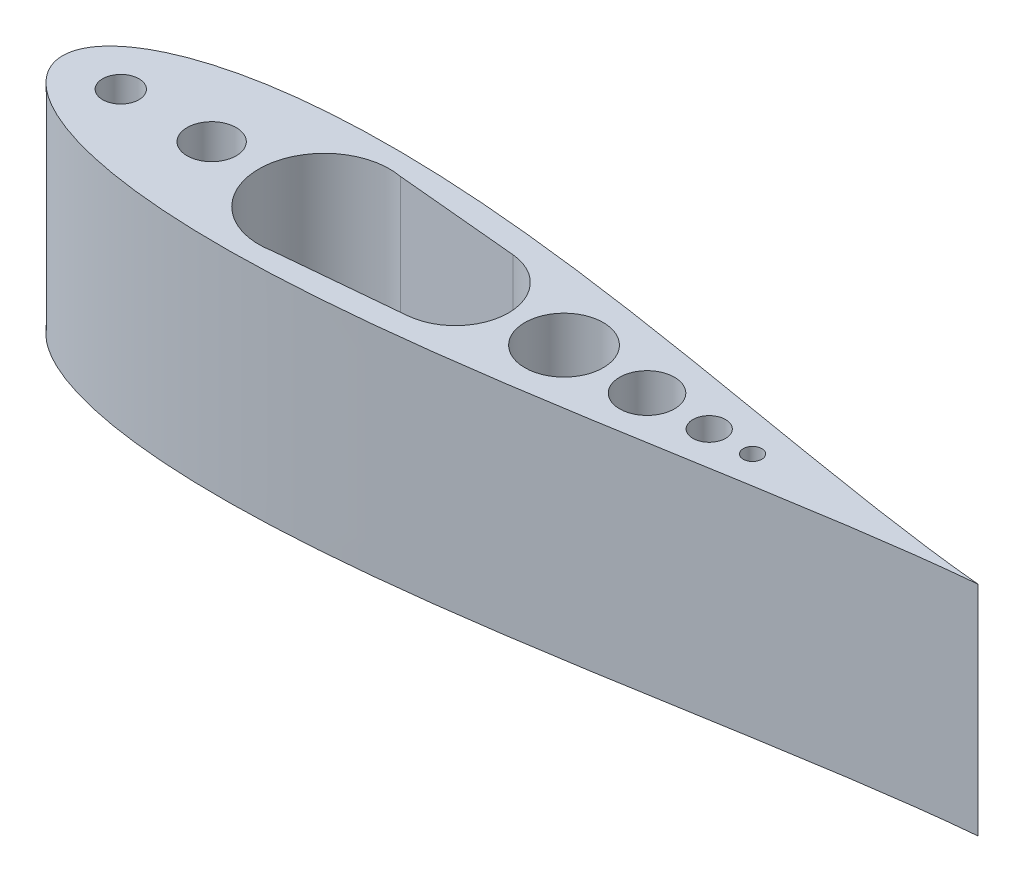
ISO-10303-21;
HEADER;
FILE_DESCRIPTION(('STEP AP214'),'2;1');
FILE_NAME('part.step','',(''),(''),'','','');
FILE_SCHEMA(('AUTOMOTIVE_DESIGN { 1 0 10303 214 1 1 1 1 }'));
ENDSEC;
DATA;
#1=APPLICATION_CONTEXT('core data for automotive mechanical design processes');
#2=APPLICATION_PROTOCOL_DEFINITION('international standard','automotive_design',2000,#1);
#3=PRODUCT_CONTEXT('',#1,'mechanical');
#4=PRODUCT('Part','Part','',(#3));
#5=PRODUCT_RELATED_PRODUCT_CATEGORY('part','',(#4));
#6=PRODUCT_DEFINITION_FORMATION('','',#4);
#7=PRODUCT_DEFINITION_CONTEXT('part definition',#1,'design');
#8=PRODUCT_DEFINITION('design','',#6,#7);
#9=PRODUCT_DEFINITION_SHAPE('','',#8);
#10=(LENGTH_UNIT() NAMED_UNIT(*) SI_UNIT(.MILLI.,.METRE.));
#11=(NAMED_UNIT(*) PLANE_ANGLE_UNIT() SI_UNIT($,.RADIAN.));
#12=(NAMED_UNIT(*) SI_UNIT($,.STERADIAN.) SOLID_ANGLE_UNIT());
#13=UNCERTAINTY_MEASURE_WITH_UNIT(LENGTH_MEASURE(1.E-05),#10,'distance_accuracy_value','');
#14=(GEOMETRIC_REPRESENTATION_CONTEXT(3) GLOBAL_UNCERTAINTY_ASSIGNED_CONTEXT((#13)) GLOBAL_UNIT_ASSIGNED_CONTEXT((#10,
#11,#12)) REPRESENTATION_CONTEXT('',''));
#15=CARTESIAN_POINT('',(0.,0.,0.));
#16=DIRECTION('',(0.,0.,1.));
#17=DIRECTION('',(1.,0.,0.));
#18=AXIS2_PLACEMENT_3D('',#15,#16,#17);
#19=CARTESIAN_POINT('',(1.01618101338774,50.8000000000002,10.8993353954472));
#20=DIRECTION('',(-0.0928307105142229,0.,-0.995681906627513));
#21=DIRECTION('',(-0.995681906627513,0.,0.0928307105142229));
#22=AXIS2_PLACEMENT_3D('',#19,#20,#21);
#23=PLANE('',#22);
#24=DIRECTION('',(0.995681906627513,0.,-0.0928307105142229));
#25=VECTOR('',#24,1.);
#26=CARTESIAN_POINT('',(1.0161810133904,0.,10.8993353954477));
#27=LINE('',#26,#25);
#28=CARTESIAN_POINT('',(-42.7235764956553,0.,14.9773373559711));
#29=VERTEX_POINT('',#28);
#30=CARTESIAN_POINT('',(-13.8473201339071,0.,12.2851086660564));
#31=VERTEX_POINT('',#30);
#32=EDGE_CURVE('E202',#29,#31,#27,.T.);
#33=ORIENTED_EDGE('',*,*,#32,.F.);
#34=DIRECTION('',(0.,-1.,0.));
#35=VECTOR('',#34,1.);
#36=CARTESIAN_POINT('',(-42.7235764956557,50.8000000000002,14.9773373559701));
#37=LINE('',#36,#35);
#38=CARTESIAN_POINT('',(-42.7235764956557,50.8000000000002,14.9773373559701));
#39=VERTEX_POINT('',#38);
#40=EDGE_CURVE('E13',#39,#29,#37,.T.);
#41=ORIENTED_EDGE('',*,*,#40,.F.);
#42=DIRECTION('',(0.995681906627513,0.,-0.0928307105142229));
#43=VECTOR('',#42,1.);
#44=CARTESIAN_POINT('',(1.01618101338774,50.8000000000002,10.8993353954472));
#45=LINE('',#44,#43);
#46=CARTESIAN_POINT('',(-13.8473201339049,50.8000000000002,12.2851086660559));
#47=VERTEX_POINT('',#46);
#48=EDGE_CURVE('E149',#39,#47,#45,.T.);
#49=ORIENTED_EDGE('',*,*,#48,.T.);
#50=DIRECTION('',(0.,-1.,0.));
#51=VECTOR('',#50,1.);
#52=CARTESIAN_POINT('',(-13.8473201339049,50.8000000000002,12.2851086660559));
#53=LINE('',#52,#51);
#54=EDGE_CURVE('E78',#47,#31,#53,.T.);
#55=ORIENTED_EDGE('',*,*,#54,.T.);
#56=EDGE_LOOP('',(#33,#41,#49,#55));
#57=FACE_BOUND('',#56,.T.);
#58=ADVANCED_FACE('F54',(#57),#23,.T.);
#59=CARTESIAN_POINT('',(-45.5408385930507,50.8000000000002,-6.66133814775094E-13));
#60=DIRECTION('',(0.,-1.,0.));
#61=DIRECTION('',(0.,0.,-0.999999999999999));
#62=AXIS2_PLACEMENT_3D('',#59,#60,#61);
#63=CYLINDRICAL_SURFACE('',#62,15.24);
#64=CARTESIAN_POINT('',(-45.5408385930507,0.,-6.66133814775094E-13));
#65=DIRECTION('',(0.,1.,0.));
#66=DIRECTION('',(0.,0.,0.999999999999999));
#67=AXIS2_PLACEMENT_3D('',#64,#65,#66);
#68=CIRCLE('',#67,15.24);
#69=CARTESIAN_POINT('',(-42.7235764956562,0.,-14.9773373559718));
#70=VERTEX_POINT('',#69);
#71=EDGE_CURVE('E134',#70,#29,#68,.T.);
#72=ORIENTED_EDGE('',*,*,#71,.F.);
#73=DIRECTION('',(0.,-1.,0.));
#74=VECTOR('',#73,1.);
#75=CARTESIAN_POINT('',(-42.7235764956562,50.8000000000002,-14.9773373559718));
#76=LINE('',#75,#74);
#77=CARTESIAN_POINT('',(-42.7235764956562,50.8000000000002,-14.9773373559718));
#78=VERTEX_POINT('',#77);
#79=EDGE_CURVE('E66',#78,#70,#76,.T.);
#80=ORIENTED_EDGE('',*,*,#79,.F.);
#81=CARTESIAN_POINT('',(-45.5408385930507,50.8000000000002,-6.66133814775094E-13));
#82=DIRECTION('',(0.,1.,0.));
#83=DIRECTION('',(0.,0.,0.999999999999999));
#84=AXIS2_PLACEMENT_3D('',#81,#82,#83);
#85=CIRCLE('',#84,15.24);
#86=EDGE_CURVE('E132',#78,#39,#85,.T.);
#87=ORIENTED_EDGE('',*,*,#86,.T.);
#88=ORIENTED_EDGE('',*,*,#40,.T.);
#89=EDGE_LOOP('',(#72,#80,#87,#88));
#90=FACE_BOUND('',#89,.T.);
#91=ADVANCED_FACE('F130',(#90),#63,.F.);
#92=CARTESIAN_POINT('',(1.01618101338996,50.8000000000002,-10.8993353954502));
#93=DIRECTION('',(0.0928307105141881,0.,-0.995681906627529));
#94=DIRECTION('',(-0.99568190662752,0.,-0.0928307105141876));
#95=AXIS2_PLACEMENT_3D('',#92,#93,#94);
#96=PLANE('',#95);
#97=DIRECTION('',(0.99568190662752,0.,0.0928307105141876));
#98=VECTOR('',#97,1.);
#99=CARTESIAN_POINT('',(1.01618101339174,0.,-10.8993353954501));
#100=LINE('',#99,#98);
#101=CARTESIAN_POINT('',(-13.8473201339064,0.,-12.2851086660578));
#102=VERTEX_POINT('',#101);
#103=EDGE_CURVE('E207',#70,#102,#100,.T.);
#104=ORIENTED_EDGE('',*,*,#103,.T.);
#105=DIRECTION('',(0.,-1.,0.));
#106=VECTOR('',#105,1.);
#107=CARTESIAN_POINT('',(-13.8473201339067,50.8000000000002,-12.2851086660578));
#108=LINE('',#107,#106);
#109=CARTESIAN_POINT('',(-13.8473201339067,50.8000000000002,-12.2851086660578));
#110=VERTEX_POINT('',#109);
#111=EDGE_CURVE('E103',#110,#102,#108,.T.);
#112=ORIENTED_EDGE('',*,*,#111,.F.);
#113=DIRECTION('',(0.99568190662752,0.,0.0928307105141876));
#114=VECTOR('',#113,1.);
#115=CARTESIAN_POINT('',(1.01618101338996,50.8000000000002,-10.8993353954502));
#116=LINE('',#115,#114);
#117=EDGE_CURVE('E139',#78,#110,#116,.T.);
#118=ORIENTED_EDGE('',*,*,#117,.F.);
#119=ORIENTED_EDGE('',*,*,#79,.T.);
#120=EDGE_LOOP('',(#104,#112,#118,#119));
#121=FACE_BOUND('',#120,.T.);
#122=ADVANCED_FACE('F140',(#121),#96,.F.);
#123=CARTESIAN_POINT('',(-106.482983395141,50.8000000000002,-7.35711491728352E-09));
#124=CARTESIAN_POINT('',(-106.481988205194,50.8000000000002,-0.336221446682217));
#125=CARTESIAN_POINT('',(-106.427915569485,50.8000000000002,-1.17247085157146));
#126=CARTESIAN_POINT('',(-106.105951463751,50.8000000000002,-2.64309926860695));
#127=CARTESIAN_POINT('',(-105.314009735291,50.8000000000002,-4.47521740832113));
#128=CARTESIAN_POINT('',(-103.897531118632,50.8000000000002,-6.50434841864622));
#129=CARTESIAN_POINT('',(-101.808045378182,50.8000000000002,-8.57165133235582));
#130=CARTESIAN_POINT('',(-99.0667178405027,50.8000000000002,-10.5675567036545));
#131=CARTESIAN_POINT('',(-95.7198031883872,50.8000000000002,-12.4267472996131));
#132=CARTESIAN_POINT('',(-91.8173324289486,50.8000000000002,-14.1114417112703));
#133=CARTESIAN_POINT('',(-87.4067018354783,50.8000000000002,-15.5993181619873));
#134=CARTESIAN_POINT('',(-82.5319070115311,50.8000000000002,-16.8771333229454));
#135=CARTESIAN_POINT('',(-77.2341496539688,50.8000000000002,-17.9374356197238));
#136=CARTESIAN_POINT('',(-71.5526070979129,50.8000000000002,-18.7767405724233));
#137=CARTESIAN_POINT('',(-65.5251476056229,50.8000000000002,-19.3954605858546));
#138=CARTESIAN_POINT('',(-59.1885914175649,50.8000000000002,-19.796574030114));
#139=CARTESIAN_POINT('',(-52.5790530798464,50.8000000000002,-19.9862763161083));
#140=CARTESIAN_POINT('',(-45.7320019639342,50.8000000000002,-19.9728658373552));
#141=CARTESIAN_POINT('',(-38.6823636938898,50.8000000000002,-19.767322469751));
#142=CARTESIAN_POINT('',(-31.4645229280415,50.8000000000002,-19.3825524779145));
#143=CARTESIAN_POINT('',(-24.1123351486494,50.8000000000002,-18.8333174672924));
#144=CARTESIAN_POINT('',(-16.6591158210672,50.8000000000002,-18.1360009675592));
#145=CARTESIAN_POINT('',(-9.13763404320456,50.8000000000002,-17.308302016678));
#146=CARTESIAN_POINT('',(-1.58011288129267,50.8000000000002,-16.3689060143253));
#147=CARTESIAN_POINT('',(5.98177290974711,50.8000000000002,-15.3372135342327));
#148=CARTESIAN_POINT('',(13.516891028539,50.8000000000002,-14.2329994071528));
#149=CARTESIAN_POINT('',(20.9946456094969,50.8000000000002,-13.0761298482217));
#150=CARTESIAN_POINT('',(28.3849687391617,50.8000000000002,-11.8862100008007));
#151=CARTESIAN_POINT('',(35.658323250916,50.8000000000002,-10.6823363143886));
#152=CARTESIAN_POINT('',(42.7857029072638,50.8000000000002,-9.48275912363772));
#153=CARTESIAN_POINT('',(49.7386474254316,50.8000000000002,-8.30463778684876));
#154=CARTESIAN_POINT('',(56.4892656841125,50.8000000000002,-7.16376071809477));
#155=CARTESIAN_POINT('',(63.0102811144397,50.8000000000002,-6.07435669901601));
#156=CARTESIAN_POINT('',(69.2750767276764,50.8000000000002,-5.04884141157447));
#157=CARTESIAN_POINT('',(75.2577811056072,50.8000000000002,-4.09769207062927));
#158=CARTESIAN_POINT('',(80.9333433114536,50.8000000000002,-3.22931724888975));
#159=CARTESIAN_POINT('',(86.2776693757101,50.8000000000002,-2.44984621283573));
#160=CARTESIAN_POINT('',(91.2676183232592,50.8000000000002,-1.76329204938852));
#161=CARTESIAN_POINT('',(95.8816071163993,50.8000000000002,-1.17122475958265));
#162=CARTESIAN_POINT('',(100.098099776026,50.8000000000002,-0.673119163771663));
#163=CARTESIAN_POINT('',(103.673185129137,50.8000000000002,-0.290516392496332));
#164=CARTESIAN_POINT('',(105.836141219668,50.8000000000002,-0.081745653859544));
#165=CARTESIAN_POINT('',(106.733370690548,50.8000000000002,-7.30127069914488E-09));
#166=B_SPLINE_CURVE_WITH_KNOTS('',3,(#123,#124,#125,#126,#127,#128,#129,#130,#131,#132,#133,
#134,#135,#136,#137,#138,#139,#140,#141,#142,#143,#144,#145,#146,#147,#148,#149,#150,#151,#152,
#153,#154,#155,#156,#157,#158,#159,#160,#161,#162,#163,#164,#165),.UNSPECIFIED.,.F.,.F.,(4,1,1,
1,1,1,1,1,1,1,1,1,1,1,1,1,1,1,1,1,1,1,1,1,1,1,1,1,1,1,1,1,1,1,1,1,1,1,1,1,4),(0.5,
0.502166768562745,0.505390167385713,0.509655974305835,0.514947681887198,0.521244711429097,
0.528520886222697,0.536744945012688,0.545881360311019,0.555890751085959,0.566730118512969,
0.578352990409744,0.59070958813284,0.603747039427916,0.617409572172202,0.631638768029288,
0.646373793426418,0.66155165817642,0.677107482822761,0.692974771091203,0.709085712601986,
0.725371443301651,0.741762353139131,0.758188398075751,0.774579367488477,0.790865214368963,
0.806976331929698,0.822843867373426,0.838400001999155,0.853578261502887,0.868313774347479,
0.882543568085681,0.896206835422454,0.909245173309164,0.921602869650348,0.933227116385514,
0.944068236336681,0.954079898096736,0.963219316327445,0.971447444986932,0.977251073986684),.UNSPECIFIED.);
#167=DIRECTION('',(0.,-1.,0.));
#168=VECTOR('',#167,1.);
#169=SURFACE_OF_LINEAR_EXTRUSION('',#166,#168);
#170=CARTESIAN_POINT('',(-106.48298339514,0.,-7.35644878346875E-09));
#171=CARTESIAN_POINT('',(-106.481988205194,0.,-0.336221446682439));
#172=CARTESIAN_POINT('',(-106.427915569481,0.,-1.17247085156924));
#173=CARTESIAN_POINT('',(-106.10595146375,0.,-2.64309926860518));
#174=CARTESIAN_POINT('',(-105.314009735291,0.,-4.47521740832113));
#175=CARTESIAN_POINT('',(-103.897531118632,0.,-6.50434841864622));
#176=CARTESIAN_POINT('',(-101.808045378182,0.,-8.57165133235582));
#177=CARTESIAN_POINT('',(-99.0667178405016,0.,-10.5675567036544));
#178=CARTESIAN_POINT('',(-95.7198031883877,0.,-12.4267472996129));
#179=CARTESIAN_POINT('',(-91.8173324289491,0.,-14.1114417112695));
#180=CARTESIAN_POINT('',(-87.4067018354761,0.,-15.599318161988));
#181=CARTESIAN_POINT('',(-82.5319070115311,0.,-16.8771333229454));
#182=CARTESIAN_POINT('',(-77.2341496539699,0.,-17.9374356197234));
#183=CARTESIAN_POINT('',(-71.5526070979142,0.,-18.7767405724225));
#184=CARTESIAN_POINT('',(-65.5251476056229,0.,-19.3954605858546));
#185=CARTESIAN_POINT('',(-59.1885914175649,0.,-19.796574030114));
#186=CARTESIAN_POINT('',(-52.5790530798464,0.,-19.9862763161083));
#187=CARTESIAN_POINT('',(-45.7320019639342,0.,-19.9728658373552));
#188=CARTESIAN_POINT('',(-38.6823636938896,0.,-19.7673224697512));
#189=CARTESIAN_POINT('',(-31.464522928041,0.,-19.3825524779148));
#190=CARTESIAN_POINT('',(-24.1123351486494,0.,-18.8333174672924));
#191=CARTESIAN_POINT('',(-16.6591158210672,0.,-18.1360009675592));
#192=CARTESIAN_POINT('',(-9.13763404320456,0.,-17.308302016678));
#193=CARTESIAN_POINT('',(-1.58011288128979,0.,-16.3689060143264));
#194=CARTESIAN_POINT('',(5.98177290974622,0.,-15.3372135342329));
#195=CARTESIAN_POINT('',(13.5168910285355,0.,-14.2329994071548));
#196=CARTESIAN_POINT('',(20.9946456094969,0.,-13.0761298482217));
#197=CARTESIAN_POINT('',(28.384968739162,0.,-11.8862100007999));
#198=CARTESIAN_POINT('',(35.658323250916,0.,-10.6823363143886));
#199=CARTESIAN_POINT('',(42.7857029072638,0.,-9.48275912363661));
#200=CARTESIAN_POINT('',(49.7386474254316,0.,-8.30463778684876));
#201=CARTESIAN_POINT('',(56.4892656841125,0.,-7.16376071809477));
#202=CARTESIAN_POINT('',(63.0102811144417,0.,-6.07435669901546));
#203=CARTESIAN_POINT('',(69.2750767276742,0.,-5.0488414115728));
#204=CARTESIAN_POINT('',(75.2577811056092,0.,-4.09769207062871));
#205=CARTESIAN_POINT('',(80.9333433114536,0.,-3.22931724888975));
#206=CARTESIAN_POINT('',(86.2776693757101,0.,-2.44984621283573));
#207=CARTESIAN_POINT('',(91.2676183232592,0.,-1.76329204938852));
#208=CARTESIAN_POINT('',(95.8816071164008,0.,-1.1712247595822));
#209=CARTESIAN_POINT('',(100.098099776027,0.,-0.673119163771663));
#210=CARTESIAN_POINT('',(103.673185129136,0.,-0.290516392495777));
#211=CARTESIAN_POINT('',(105.836141219668,0.,-0.081745653859322));
#212=CARTESIAN_POINT('',(106.733370690548,0.,-7.30115967684242E-09));
#213=B_SPLINE_CURVE_WITH_KNOTS('',3,(#170,#171,#172,#173,#174,#175,#176,#177,#178,#179,#180,
#181,#182,#183,#184,#185,#186,#187,#188,#189,#190,#191,#192,#193,#194,#195,#196,#197,#198,#199,
#200,#201,#202,#203,#204,#205,#206,#207,#208,#209,#210,#211,#212),.UNSPECIFIED.,.F.,.F.,(4,1,1,
1,1,1,1,1,1,1,1,1,1,1,1,1,1,1,1,1,1,1,1,1,1,1,1,1,1,1,1,1,1,1,1,1,1,1,1,1,4),(0.5,
0.502166768562745,0.505390167385713,0.509655974305835,0.514947681887198,0.521244711429097,
0.528520886222697,0.536744945012688,0.545881360311019,0.555890751085959,0.566730118512969,
0.578352990409744,0.59070958813284,0.603747039427916,0.617409572172202,0.631638768029288,
0.646373793426418,0.66155165817642,0.677107482822761,0.692974771091203,0.709085712601986,
0.725371443301651,0.741762353139131,0.758188398075751,0.774579367488477,0.790865214368963,
0.806976331929698,0.822843867373426,0.838400001999155,0.853578261502887,0.868313774347479,
0.882543568085681,0.896206835422454,0.909245173309164,0.921602869650348,0.933227116385514,
0.944068236336681,0.954079898096736,0.963219316327445,0.971447444986932,0.977251073986684),.UNSPECIFIED.);
#214=CARTESIAN_POINT('',(-106.48298339514,0.,-7.35644878346875E-09));
#215=VERTEX_POINT('',#214);
#216=CARTESIAN_POINT('',(106.73337069055,0.,7.30027149842272E-09));
#217=VERTEX_POINT('',#216);
#218=EDGE_CURVE('E181',#215,#217,#213,.T.);
#219=ORIENTED_EDGE('',*,*,#218,.F.);
#220=DIRECTION('',(0.,-1.,0.));
#221=VECTOR('',#220,1.);
#222=CARTESIAN_POINT('',(-106.482983395141,50.8000000000002,-7.35711491728352E-09));
#223=LINE('',#222,#221);
#224=CARTESIAN_POINT('',(-106.482983395141,50.8000000000002,-7.35711491728352E-09));
#225=VERTEX_POINT('',#224);
#226=EDGE_CURVE('E59',#225,#215,#223,.T.);
#227=ORIENTED_EDGE('',*,*,#226,.F.);
#228=CARTESIAN_POINT('',(106.73337069055,50.8000000000002,7.29816207467593E-09));
#229=VERTEX_POINT('',#228);
#230=EDGE_CURVE('E234',#225,#229,#166,.T.);
#231=ORIENTED_EDGE('',*,*,#230,.T.);
#232=DIRECTION('',(0.,-1.,0.));
#233=VECTOR('',#232,1.);
#234=CARTESIAN_POINT('',(106.73337069055,50.8000000000002,7.29816207467593E-09));
#235=LINE('',#234,#233);
#236=EDGE_CURVE('E180',#229,#217,#235,.T.);
#237=ORIENTED_EDGE('',*,*,#236,.T.);
#238=EDGE_LOOP('',(#219,#227,#231,#237));
#239=FACE_BOUND('',#238,.T.);
#240=ADVANCED_FACE('F56',(#239),#169,.T.);
#241=CARTESIAN_POINT('',(44.1262695669535,50.8000000000002,-2.22044604925031E-13));
#242=DIRECTION('',(0.,-1.,0.));
#243=DIRECTION('',(0.,0.,-0.999999999999999));
#244=AXIS2_PLACEMENT_3D('',#241,#242,#243);
#245=CYLINDRICAL_SURFACE('',#244,3.80999999961901);
#246=CARTESIAN_POINT('',(44.1262695669535,50.8000000000002,-2.22044604925031E-13));
#247=DIRECTION('',(0.,1.,0.));
#248=DIRECTION('',(0.,0.,0.999999999999999));
#249=AXIS2_PLACEMENT_3D('',#246,#247,#248);
#250=CIRCLE('',#249,3.80999999961901);
#251=CARTESIAN_POINT('',(44.1262695669535,50.8000000000002,3.80999999961878));
#252=VERTEX_POINT('',#251);
#253=EDGE_CURVE('E172',#252,#252,#250,.T.);
#254=ORIENTED_EDGE('',*,*,#253,.T.);
#255=EDGE_LOOP('',(#254));
#256=FACE_BOUND('',#255,.T.);
#257=CARTESIAN_POINT('',(44.1262695669535,0.,-2.22044604925031E-13));
#258=DIRECTION('',(0.,1.,0.));
#259=DIRECTION('',(0.,0.,0.999999999999999));
#260=AXIS2_PLACEMENT_3D('',#257,#258,#259);
#261=CIRCLE('',#260,3.80999999961901);
#262=CARTESIAN_POINT('',(44.1262695669535,0.,3.80999999961878));
#263=VERTEX_POINT('',#262);
#264=EDGE_CURVE('E226',#263,#263,#261,.T.);
#265=ORIENTED_EDGE('',*,*,#264,.F.);
#266=EDGE_LOOP('',(#265));
#267=FACE_BOUND('',#266,.T.);
#268=ADVANCED_FACE('F252',(#256,#267),#245,.F.);
#269=CARTESIAN_POINT('',(29.6435174290028,50.8000000000002,-1.99840144432528E-12));
#270=DIRECTION('',(0.,-1.,0.));
#271=DIRECTION('',(0.,0.,-0.999999999999999));
#272=AXIS2_PLACEMENT_3D('',#269,#270,#271);
#273=CYLINDRICAL_SURFACE('',#272,6.39233333269412);
#274=CARTESIAN_POINT('',(29.6435174290028,50.8000000000002,-1.99840144432528E-12));
#275=DIRECTION('',(0.,1.,0.));
#276=DIRECTION('',(0.,0.,0.999999999999999));
#277=AXIS2_PLACEMENT_3D('',#274,#275,#276);
#278=CIRCLE('',#277,6.39233333269412);
#279=CARTESIAN_POINT('',(29.6435174290028,50.8000000000002,6.39233333269212));
#280=VERTEX_POINT('',#279);
#281=EDGE_CURVE('E168',#280,#280,#278,.T.);
#282=ORIENTED_EDGE('',*,*,#281,.T.);
#283=EDGE_LOOP('',(#282));
#284=FACE_BOUND('',#283,.T.);
#285=CARTESIAN_POINT('',(29.6435174290006,0.,-4.44089209850063E-13));
#286=DIRECTION('',(0.,1.,0.));
#287=DIRECTION('',(0.,0.,0.999999999999999));
#288=AXIS2_PLACEMENT_3D('',#285,#286,#287);
#289=CIRCLE('',#288,6.39233333269412);
#290=CARTESIAN_POINT('',(29.6435174290006,0.,6.39233333269367));
#291=VERTEX_POINT('',#290);
#292=EDGE_CURVE('E222',#291,#291,#289,.T.);
#293=ORIENTED_EDGE('',*,*,#292,.F.);
#294=EDGE_LOOP('',(#293));
#295=FACE_BOUND('',#294,.T.);
#296=ADVANCED_FACE('F257',(#284,#295),#273,.F.);
#297=CARTESIAN_POINT('',(-71.7704466196358,50.8000000000002,-2.1094237467878E-12));
#298=DIRECTION('',(0.,-1.,0.));
#299=DIRECTION('',(0.,0.,-0.999999999999999));
#300=AXIS2_PLACEMENT_3D('',#297,#298,#299);
#301=CYLINDRICAL_SURFACE('',#300,5.71499999999999);
#302=CARTESIAN_POINT('',(-71.7704466196358,50.8000000000002,-2.1094237467878E-12));
#303=DIRECTION('',(0.,1.,0.));
#304=DIRECTION('',(0.,0.,0.999999999999999));
#305=AXIS2_PLACEMENT_3D('',#302,#303,#304);
#306=CIRCLE('',#305,5.71499999999999);
#307=CARTESIAN_POINT('',(-71.7704466196358,50.8000000000002,5.71499999999788));
#308=VERTEX_POINT('',#307);
#309=EDGE_CURVE('E164',#308,#308,#306,.T.);
#310=ORIENTED_EDGE('',*,*,#309,.T.);
#311=EDGE_LOOP('',(#310));
#312=FACE_BOUND('',#311,.T.);
#313=CARTESIAN_POINT('',(-71.7704466196329,0.,-2.66453525910038E-12));
#314=DIRECTION('',(0.,1.,0.));
#315=DIRECTION('',(0.,0.,0.999999999999999));
#316=AXIS2_PLACEMENT_3D('',#313,#314,#315);
#317=CIRCLE('',#316,5.71499999999999);
#318=CARTESIAN_POINT('',(-71.7704466196329,0.,5.71499999999733));
#319=VERTEX_POINT('',#318);
#320=EDGE_CURVE('E218',#319,#319,#317,.T.);
#321=ORIENTED_EDGE('',*,*,#320,.F.);
#322=EDGE_LOOP('',(#321));
#323=FACE_BOUND('',#322,.T.);
#324=ADVANCED_FACE('F302',(#312,#323),#301,.F.);
#325=CARTESIAN_POINT('',(10.3101726344379,50.8000000000002,-5.55111512312578E-13));
#326=DIRECTION('',(0.,-1.,0.));
#327=DIRECTION('',(0.,0.,-0.999999999999999));
#328=AXIS2_PLACEMENT_3D('',#325,#326,#327);
#329=CYLINDRICAL_SURFACE('',#328,9.13101146225404);
#330=CARTESIAN_POINT('',(10.3101726344379,50.8000000000002,-5.55111512312578E-13));
#331=DIRECTION('',(0.,1.,0.));
#332=DIRECTION('',(0.,0.,0.999999999999999));
#333=AXIS2_PLACEMENT_3D('',#330,#331,#332);
#334=CIRCLE('',#333,9.13101146225404);
#335=CARTESIAN_POINT('',(10.3101726344379,50.8000000000002,9.13101146225348));
#336=VERTEX_POINT('',#335);
#337=EDGE_CURVE('E160',#336,#336,#334,.T.);
#338=ORIENTED_EDGE('',*,*,#337,.T.);
#339=EDGE_LOOP('',(#338));
#340=FACE_BOUND('',#339,.T.);
#341=CARTESIAN_POINT('',(10.3101726344379,0.,-5.55111512312578E-13));
#342=DIRECTION('',(0.,1.,0.));
#343=DIRECTION('',(0.,0.,0.999999999999999));
#344=AXIS2_PLACEMENT_3D('',#341,#342,#343);
#345=CIRCLE('',#344,9.13101146225404);
#346=CARTESIAN_POINT('',(10.3101726344379,0.,9.13101146225348));
#347=VERTEX_POINT('',#346);
#348=EDGE_CURVE('E214',#347,#347,#345,.T.);
#349=ORIENTED_EDGE('',*,*,#348,.F.);
#350=EDGE_LOOP('',(#349));
#351=FACE_BOUND('',#350,.T.);
#352=ADVANCED_FACE('F306',(#340,#351),#329,.F.);
#353=CARTESIAN_POINT('',(-14.9927013632145,50.8000000000002,-1.11022302462516E-13));
#354=DIRECTION('',(0.,-1.,0.));
#355=DIRECTION('',(0.,0.,-0.999999999999999));
#356=AXIS2_PLACEMENT_3D('',#353,#354,#355);
#357=CYLINDRICAL_SURFACE('',#356,12.3383869730725);
#358=CARTESIAN_POINT('',(-14.9927013632145,0.,-1.11022302462516E-13));
#359=DIRECTION('',(0.,1.,0.));
#360=DIRECTION('',(0.,0.,0.999999999999999));
#361=AXIS2_PLACEMENT_3D('',#358,#359,#360);
#362=CIRCLE('',#361,12.3383869730725);
#363=EDGE_CURVE('E210',#31,#102,#362,.T.);
#364=ORIENTED_EDGE('',*,*,#363,.F.);
#365=ORIENTED_EDGE('',*,*,#54,.F.);
#366=CARTESIAN_POINT('',(-14.9927013632145,50.8000000000002,-1.11022302462516E-13));
#367=DIRECTION('',(0.,1.,0.));
#368=DIRECTION('',(0.,0.,0.999999999999999));
#369=AXIS2_PLACEMENT_3D('',#366,#367,#368);
#370=CIRCLE('',#369,12.3383869730725);
#371=EDGE_CURVE('E144',#47,#110,#370,.T.);
#372=ORIENTED_EDGE('',*,*,#371,.T.);
#373=ORIENTED_EDGE('',*,*,#111,.T.);
#374=EDGE_LOOP('',(#364,#365,#372,#373));
#375=FACE_BOUND('',#374,.T.);
#376=ADVANCED_FACE('F270',(#375),#357,.F.);
#377=CARTESIAN_POINT('',(-92.9371132841859,50.8000000000002,2.22044604925031E-13));
#378=DIRECTION('',(0.,-1.,0.));
#379=DIRECTION('',(0.,0.,-0.999999999999999));
#380=AXIS2_PLACEMENT_3D('',#377,#378,#379);
#381=CYLINDRICAL_SURFACE('',#380,4.23333333291002);
#382=CARTESIAN_POINT('',(-92.9371132841859,50.8000000000002,2.22044604925031E-13));
#383=DIRECTION('',(0.,1.,0.));
#384=DIRECTION('',(0.,0.,0.999999999999999));
#385=AXIS2_PLACEMENT_3D('',#382,#383,#384);
#386=CIRCLE('',#385,4.23333333291002);
#387=CARTESIAN_POINT('',(-92.9371132841859,50.8000000000002,4.23333333291024));
#388=VERTEX_POINT('',#387);
#389=EDGE_CURVE('E154',#388,#388,#386,.T.);
#390=ORIENTED_EDGE('',*,*,#389,.T.);
#391=EDGE_LOOP('',(#390));
#392=FACE_BOUND('',#391,.T.);
#393=CARTESIAN_POINT('',(-92.9371132841859,0.,2.22044604925031E-13));
#394=DIRECTION('',(0.,1.,0.));
#395=DIRECTION('',(0.,0.,0.999999999999999));
#396=AXIS2_PLACEMENT_3D('',#393,#394,#395);
#397=CIRCLE('',#396,4.23333333291002);
#398=CARTESIAN_POINT('',(-92.9371132841859,0.,4.23333333291024));
#399=VERTEX_POINT('',#398);
#400=EDGE_CURVE('E195',#399,#399,#397,.T.);
#401=ORIENTED_EDGE('',*,*,#400,.F.);
#402=EDGE_LOOP('',(#401));
#403=FACE_BOUND('',#402,.T.);
#404=ADVANCED_FACE('F268',(#392,#403),#381,.F.);
#405=CARTESIAN_POINT('',(-106.482983394799,50.8000000000002,7.3551165158392E-09));
#406=CARTESIAN_POINT('',(-106.481988204852,50.8000000000002,0.33622144668044));
#407=CARTESIAN_POINT('',(-106.42791556914,50.8000000000002,1.17247085156691));
#408=CARTESIAN_POINT('',(-106.105951463409,50.8000000000002,2.64309926860007));
#409=CARTESIAN_POINT('',(-105.314009734953,50.8000000000002,4.4752174083118));
#410=CARTESIAN_POINT('',(-103.897531118299,50.8000000000002,6.50434841863257));
#411=CARTESIAN_POINT('',(-101.80804537785,50.8000000000002,8.57165133233928));
#412=CARTESIAN_POINT('',(-99.0667178401712,50.8000000000002,10.5675567036368));
#413=CARTESIAN_POINT('',(-95.7198031880639,50.8000000000002,12.4267472995933));
#414=CARTESIAN_POINT('',(-91.8173324286338,50.8000000000002,14.1114417112435));
#415=CARTESIAN_POINT('',(-87.4067018351643,50.8000000000002,15.5993181619597));
#416=CARTESIAN_POINT('',(-82.5319070112292,50.8000000000002,16.8771333229181));
#417=CARTESIAN_POINT('',(-77.234149653675,50.8000000000002,17.9374356196936));
#418=CARTESIAN_POINT('',(-71.5526070976247,50.8000000000002,18.7767405723894));
#419=CARTESIAN_POINT('',(-65.525147605348,50.8000000000002,19.3954605858239));
#420=CARTESIAN_POINT('',(-59.188591417298,50.8000000000002,19.7965740300804));
#421=CARTESIAN_POINT('',(-52.5790530795893,50.8000000000002,19.9862763160744));
#422=CARTESIAN_POINT('',(-45.7320019636902,50.8000000000002,19.9728658373223));
#423=CARTESIAN_POINT('',(-38.6823636936557,50.8000000000002,19.7673224697191));
#424=CARTESIAN_POINT('',(-31.4645229278203,50.8000000000002,19.382552477883));
#425=CARTESIAN_POINT('',(-24.1123351484362,50.8000000000002,18.8333174672592));
#426=CARTESIAN_POINT('',(-16.6591158208709,50.8000000000002,18.1360009675299));
#427=CARTESIAN_POINT('',(-9.1376340430176,50.8000000000002,17.3083020166492));
#428=CARTESIAN_POINT('',(-1.58011288112014,50.8000000000002,16.368906014298));
#429=CARTESIAN_POINT('',(5.9817729099092,50.8000000000002,15.3372135342075));
#430=CARTESIAN_POINT('',(13.5168910286882,50.8000000000002,14.2329994071301));
#431=CARTESIAN_POINT('',(20.9946456096342,50.8000000000002,13.0761298481998));
#432=CARTESIAN_POINT('',(28.3849687392892,50.8000000000002,11.8862100007812));
#433=CARTESIAN_POINT('',(35.658323251031,50.8000000000002,10.6823363143695));
#434=CARTESIAN_POINT('',(42.7857029073642,50.8000000000002,9.48275912362007));
#435=CARTESIAN_POINT('',(49.7386474255208,50.8000000000002,8.30463778683466));
#436=CARTESIAN_POINT('',(56.4892656841942,50.8000000000002,7.16376071808333));
#437=CARTESIAN_POINT('',(63.0102811145101,50.8000000000002,6.07435669900491));
#438=CARTESIAN_POINT('',(69.2750767277348,50.8000000000002,5.04884141156337));
#439=CARTESIAN_POINT('',(75.2577811056614,50.8000000000002,4.09769207062116));
#440=CARTESIAN_POINT('',(80.9333433114956,50.8000000000002,3.22931724888453));
#441=CARTESIAN_POINT('',(86.2776693757437,50.8000000000002,2.44984621283106));
#442=CARTESIAN_POINT('',(91.2676183232808,50.8000000000002,1.76329204938352));
#443=CARTESIAN_POINT('',(95.8816071164144,50.8000000000002,1.17122475957965));
#444=CARTESIAN_POINT('',(100.098099776034,50.8000000000002,0.67311916376922));
#445=CARTESIAN_POINT('',(103.673185129134,50.8000000000002,0.290516392493001));
#446=CARTESIAN_POINT('',(105.836141219672,50.8000000000002,0.0817456538572126));
#447=CARTESIAN_POINT('',(106.73337069055,50.8000000000002,7.29816207467593E-09));
#448=B_SPLINE_CURVE_WITH_KNOTS('',3,(#405,#406,#407,#408,#409,#410,#411,#412,#413,#414,#415,
#416,#417,#418,#419,#420,#421,#422,#423,#424,#425,#426,#427,#428,#429,#430,#431,#432,#433,#434,
#435,#436,#437,#438,#439,#440,#441,#442,#443,#444,#445,#446,#447),.UNSPECIFIED.,.F.,.F.,(4,1,1,
1,1,1,1,1,1,1,1,1,1,1,1,1,1,1,1,1,1,1,1,1,1,1,1,1,1,1,1,1,1,1,1,1,1,1,1,1,4),(0.5,
0.502166768562745,0.505390167385713,0.509655974305835,0.514947681887198,0.521244711429097,
0.528520886222697,0.536744945012688,0.545881360311019,0.555890751085959,0.566730118512969,
0.578352990409744,0.59070958813284,0.603747039427916,0.617409572172202,0.631638768029288,
0.646373793426418,0.66155165817642,0.677107482822761,0.692974771091203,0.709085712601986,
0.725371443301651,0.741762353139131,0.758188398075751,0.774579367488477,0.790865214368963,
0.806976331929698,0.822843867373426,0.838400001999155,0.853578261502887,0.868313774347479,
0.882543568085681,0.896206835422454,0.909245173309164,0.921602869650348,0.933227116385514,
0.944068236336681,0.954079898096736,0.963219316327445,0.971447444986932,0.977251073986684),.UNSPECIFIED.);
#449=DIRECTION('',(0.,-1.,0.));
#450=VECTOR('',#449,1.);
#451=SURFACE_OF_LINEAR_EXTRUSION('',#448,#450);
#452=CARTESIAN_POINT('',(-106.482983394799,0.,7.3551165158392E-09));
#453=CARTESIAN_POINT('',(-106.481988204852,0.,0.33622144668044));
#454=CARTESIAN_POINT('',(-106.42791556914,0.,1.17247085156746));
#455=CARTESIAN_POINT('',(-106.105951463408,0.,2.64309926860007));
#456=CARTESIAN_POINT('',(-105.314009734951,0.,4.47521740831169));
#457=CARTESIAN_POINT('',(-103.897531118299,0.,6.50434841863257));
#458=CARTESIAN_POINT('',(-101.808045377846,0.,8.57165133233917));
#459=CARTESIAN_POINT('',(-99.0667178401712,0.,10.5675567036368));
#460=CARTESIAN_POINT('',(-95.7198031880635,0.,12.4267472995929));
#461=CARTESIAN_POINT('',(-91.8173324286327,0.,14.111441711245));
#462=CARTESIAN_POINT('',(-87.4067018351639,0.,15.5993181619579));
#463=CARTESIAN_POINT('',(-82.5319070112287,0.,16.8771333229178));
#464=CARTESIAN_POINT('',(-77.2341496536737,0.,17.9374356196942));
#465=CARTESIAN_POINT('',(-71.5526070976256,0.,18.776740572389));
#466=CARTESIAN_POINT('',(-65.525147605348,0.,19.3954605858239));
#467=CARTESIAN_POINT('',(-59.1885914172967,0.,19.7965740300805));
#468=CARTESIAN_POINT('',(-52.5790530795931,0.,19.986276316073));
#469=CARTESIAN_POINT('',(-45.7320019636902,0.,19.9728658373223));
#470=CARTESIAN_POINT('',(-38.6823636936557,0.,19.7673224697191));
#471=CARTESIAN_POINT('',(-31.4645229278203,0.,19.382552477883));
#472=CARTESIAN_POINT('',(-24.1123351484371,0.,18.8333174672565));
#473=CARTESIAN_POINT('',(-16.6591158208709,0.,18.1360009675299));
#474=CARTESIAN_POINT('',(-9.1376340430176,0.,17.3083020166492));
#475=CARTESIAN_POINT('',(-1.58011288112014,0.,16.368906014298));
#476=CARTESIAN_POINT('',(5.9817729099092,0.,15.3372135342075));
#477=CARTESIAN_POINT('',(13.5168910286882,0.,14.2329994071301));
#478=CARTESIAN_POINT('',(20.9946456096342,0.,13.0761298481998));
#479=CARTESIAN_POINT('',(28.3849687392892,0.,11.8862100007812));
#480=CARTESIAN_POINT('',(35.6583232510304,0.,10.68233631437));
#481=CARTESIAN_POINT('',(42.7857029073624,0.,9.48275912361995));
#482=CARTESIAN_POINT('',(49.7386474255208,0.,8.30463778683466));
#483=CARTESIAN_POINT('',(56.4892656841942,0.,7.16376071808333));
#484=CARTESIAN_POINT('',(63.0102811145101,0.,6.07435669900491));
#485=CARTESIAN_POINT('',(69.2750767277348,0.,5.04884141156337));
#486=CARTESIAN_POINT('',(75.2577811056616,0.,4.09769207062138));
#487=CARTESIAN_POINT('',(80.9333433114956,0.,3.22931724888453));
#488=CARTESIAN_POINT('',(86.2776693757437,0.,2.44984621283106));
#489=CARTESIAN_POINT('',(91.267618323283,0.,1.76329204938419));
#490=CARTESIAN_POINT('',(95.8816071164148,0.,1.17122475957931));
#491=CARTESIAN_POINT('',(100.098099776036,0.,0.673119163769442));
#492=CARTESIAN_POINT('',(103.673185129135,0.,0.29051639249289));
#493=CARTESIAN_POINT('',(105.836141219672,0.,0.0817456538572126));
#494=CARTESIAN_POINT('',(106.73337069055,0.,7.30027149842272E-09));
#495=B_SPLINE_CURVE_WITH_KNOTS('',3,(#452,#453,#454,#455,#456,#457,#458,#459,#460,#461,#462,
#463,#464,#465,#466,#467,#468,#469,#470,#471,#472,#473,#474,#475,#476,#477,#478,#479,#480,#481,
#482,#483,#484,#485,#486,#487,#488,#489,#490,#491,#492,#493,#494),.UNSPECIFIED.,.F.,.F.,(4,1,1,
1,1,1,1,1,1,1,1,1,1,1,1,1,1,1,1,1,1,1,1,1,1,1,1,1,1,1,1,1,1,1,1,1,1,1,1,1,4),(0.5,
0.502166768562745,0.505390167385713,0.509655974305835,0.514947681887198,0.521244711429097,
0.528520886222697,0.536744945012688,0.545881360311019,0.555890751085959,0.566730118512969,
0.578352990409744,0.59070958813284,0.603747039427916,0.617409572172202,0.631638768029288,
0.646373793426418,0.66155165817642,0.677107482822761,0.692974771091203,0.709085712601986,
0.725371443301651,0.741762353139131,0.758188398075751,0.774579367488477,0.790865214368963,
0.806976331929698,0.822843867373426,0.838400001999155,0.853578261502887,0.868313774347479,
0.882543568085681,0.896206835422454,0.909245173309164,0.921602869650348,0.933227116385514,
0.944068236336681,0.954079898096736,0.963219316327445,0.971447444986932,0.977251073986684),.UNSPECIFIED.);
#496=EDGE_CURVE('E187',#215,#217,#495,.T.);
#497=ORIENTED_EDGE('',*,*,#496,.T.);
#498=ORIENTED_EDGE('',*,*,#236,.F.);
#499=EDGE_CURVE('E246',#225,#229,#448,.T.);
#500=ORIENTED_EDGE('',*,*,#499,.F.);
#501=ORIENTED_EDGE('',*,*,#226,.T.);
#502=EDGE_LOOP('',(#497,#498,#500,#501));
#503=FACE_BOUND('',#502,.T.);
#504=ADVANCED_FACE('F245',(#503),#451,.F.);
#505=CARTESIAN_POINT('',(54.2103982242521,50.8000000000002,-4.44089209850063E-13));
#506=DIRECTION('',(0.,-1.,0.));
#507=DIRECTION('',(0.,0.,-0.999999999999999));
#508=AXIS2_PLACEMENT_3D('',#505,#506,#507);
#509=CYLINDRICAL_SURFACE('',#508,2.15899999978409);
#510=CARTESIAN_POINT('',(54.2103982242521,50.8000000000002,-4.44089209850063E-13));
#511=DIRECTION('',(0.,1.,0.));
#512=DIRECTION('',(0.,0.,0.999999999999999));
#513=AXIS2_PLACEMENT_3D('',#510,#511,#512);
#514=CIRCLE('',#513,2.15899999978409);
#515=CARTESIAN_POINT('',(54.2103982242521,50.8000000000002,2.15899999978364));
#516=VERTEX_POINT('',#515);
#517=EDGE_CURVE('E176',#516,#516,#514,.T.);
#518=ORIENTED_EDGE('',*,*,#517,.T.);
#519=EDGE_LOOP('',(#518));
#520=FACE_BOUND('',#519,.T.);
#521=CARTESIAN_POINT('',(54.2103982242521,0.,-4.44089209850063E-13));
#522=DIRECTION('',(0.,1.,0.));
#523=DIRECTION('',(0.,0.,0.999999999999999));
#524=AXIS2_PLACEMENT_3D('',#521,#522,#523);
#525=CIRCLE('',#524,2.15899999978409);
#526=CARTESIAN_POINT('',(54.2103982242521,0.,2.15899999978364));
#527=VERTEX_POINT('',#526);
#528=EDGE_CURVE('E230',#527,#527,#525,.T.);
#529=ORIENTED_EDGE('',*,*,#528,.F.);
#530=EDGE_LOOP('',(#529));
#531=FACE_BOUND('',#530,.T.);
#532=ADVANCED_FACE('F274',(#520,#531),#509,.F.);
#533=CARTESIAN_POINT('',(0.,50.8000000000002,0.));
#534=DIRECTION('',(0.,1.,0.));
#535=DIRECTION('',(0.,0.,0.999999999999999));
#536=AXIS2_PLACEMENT_3D('',#533,#534,#535);
#537=PLANE('',#536);
#538=ORIENTED_EDGE('',*,*,#230,.F.);
#539=ORIENTED_EDGE('',*,*,#499,.T.);
#540=EDGE_LOOP('',(#538,#539));
#541=FACE_BOUND('',#540,.T.);
#542=ORIENTED_EDGE('',*,*,#389,.F.);
#543=EDGE_LOOP('',(#542));
#544=FACE_BOUND('',#543,.T.);
#545=ORIENTED_EDGE('',*,*,#48,.F.);
#546=ORIENTED_EDGE('',*,*,#86,.F.);
#547=ORIENTED_EDGE('',*,*,#117,.T.);
#548=ORIENTED_EDGE('',*,*,#371,.F.);
#549=EDGE_LOOP('',(#545,#546,#547,#548));
#550=FACE_BOUND('',#549,.T.);
#551=ORIENTED_EDGE('',*,*,#337,.F.);
#552=EDGE_LOOP('',(#551));
#553=FACE_BOUND('',#552,.T.);
#554=ORIENTED_EDGE('',*,*,#309,.F.);
#555=EDGE_LOOP('',(#554));
#556=FACE_BOUND('',#555,.T.);
#557=ORIENTED_EDGE('',*,*,#281,.F.);
#558=EDGE_LOOP('',(#557));
#559=FACE_BOUND('',#558,.T.);
#560=ORIENTED_EDGE('',*,*,#253,.F.);
#561=EDGE_LOOP('',(#560));
#562=FACE_BOUND('',#561,.T.);
#563=ORIENTED_EDGE('',*,*,#517,.F.);
#564=EDGE_LOOP('',(#563));
#565=FACE_BOUND('',#564,.T.);
#566=ADVANCED_FACE('F147',(#541,#544,#550,#553,#556,#559,#562,#565),#537,.T.);
#567=CARTESIAN_POINT('',(0.,0.,0.));
#568=DIRECTION('',(0.,1.,0.));
#569=DIRECTION('',(0.,0.,0.999999999999999));
#570=AXIS2_PLACEMENT_3D('',#567,#568,#569);
#571=PLANE('',#570);
#572=ORIENTED_EDGE('',*,*,#218,.T.);
#573=ORIENTED_EDGE('',*,*,#496,.F.);
#574=EDGE_LOOP('',(#572,#573));
#575=FACE_BOUND('',#574,.T.);
#576=ORIENTED_EDGE('',*,*,#400,.T.);
#577=EDGE_LOOP('',(#576));
#578=FACE_BOUND('',#577,.T.);
#579=ORIENTED_EDGE('',*,*,#32,.T.);
#580=ORIENTED_EDGE('',*,*,#363,.T.);
#581=ORIENTED_EDGE('',*,*,#103,.F.);
#582=ORIENTED_EDGE('',*,*,#71,.T.);
#583=EDGE_LOOP('',(#579,#580,#581,#582));
#584=FACE_BOUND('',#583,.T.);
#585=ORIENTED_EDGE('',*,*,#348,.T.);
#586=EDGE_LOOP('',(#585));
#587=FACE_BOUND('',#586,.T.);
#588=ORIENTED_EDGE('',*,*,#320,.T.);
#589=EDGE_LOOP('',(#588));
#590=FACE_BOUND('',#589,.T.);
#591=ORIENTED_EDGE('',*,*,#292,.T.);
#592=EDGE_LOOP('',(#591));
#593=FACE_BOUND('',#592,.T.);
#594=ORIENTED_EDGE('',*,*,#264,.T.);
#595=EDGE_LOOP('',(#594));
#596=FACE_BOUND('',#595,.T.);
#597=ORIENTED_EDGE('',*,*,#528,.T.);
#598=EDGE_LOOP('',(#597));
#599=FACE_BOUND('',#598,.T.);
#600=ADVANCED_FACE('F249',(#575,#578,#584,#587,#590,#593,#596,#599),#571,.F.);
#601=CLOSED_SHELL('',(#58,#91,#122,#240,#268,#296,#324,#352,#376,#404,#504,#532,#566,#600));
#602=MANIFOLD_SOLID_BREP('B2',#601);
#603=ADVANCED_BREP_SHAPE_REPRESENTATION('',(#18,#602),#14);
#604=SHAPE_DEFINITION_REPRESENTATION(#9,#603);
ENDSEC;
END-ISO-10303-21;
